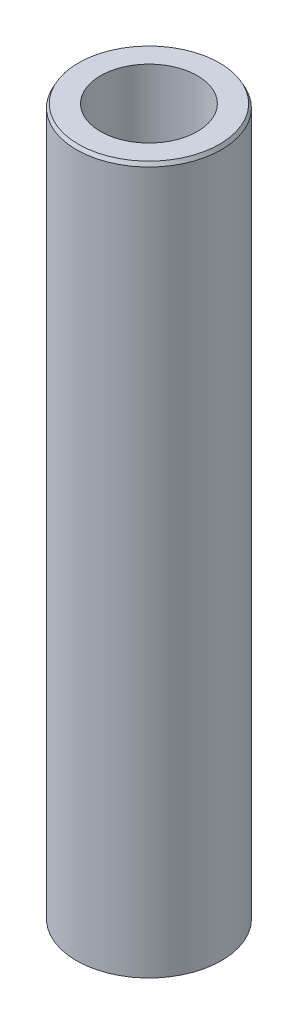
ISO-10303-21;
HEADER;
FILE_DESCRIPTION(('STEP AP214'),'2;1');
FILE_NAME('part.step','',(''),(''),'','','');
FILE_SCHEMA(('AUTOMOTIVE_DESIGN { 1 0 10303 214 1 1 1 1 }'));
ENDSEC;
DATA;
#1=APPLICATION_CONTEXT('core data for automotive mechanical design processes');
#2=APPLICATION_PROTOCOL_DEFINITION('international standard','automotive_design',2000,#1);
#3=PRODUCT_CONTEXT('',#1,'mechanical');
#4=PRODUCT('Part','Part','',(#3));
#5=PRODUCT_RELATED_PRODUCT_CATEGORY('part','',(#4));
#6=PRODUCT_DEFINITION_FORMATION('','',#4);
#7=PRODUCT_DEFINITION_CONTEXT('part definition',#1,'design');
#8=PRODUCT_DEFINITION('design','',#6,#7);
#9=PRODUCT_DEFINITION_SHAPE('','',#8);
#10=(LENGTH_UNIT() NAMED_UNIT(*) SI_UNIT(.MILLI.,.METRE.));
#11=(NAMED_UNIT(*) PLANE_ANGLE_UNIT() SI_UNIT($,.RADIAN.));
#12=(NAMED_UNIT(*) SI_UNIT($,.STERADIAN.) SOLID_ANGLE_UNIT());
#13=UNCERTAINTY_MEASURE_WITH_UNIT(LENGTH_MEASURE(1.E-05),#10,'distance_accuracy_value','');
#14=(GEOMETRIC_REPRESENTATION_CONTEXT(3) GLOBAL_UNCERTAINTY_ASSIGNED_CONTEXT((#13)) GLOBAL_UNIT_ASSIGNED_CONTEXT((#10,
#11,#12)) REPRESENTATION_CONTEXT('',''));
#15=CARTESIAN_POINT('',(0.,0.,0.));
#16=DIRECTION('',(0.,0.,1.));
#17=DIRECTION('',(1.,0.,0.));
#18=AXIS2_PLACEMENT_3D('',#15,#16,#17);
#19=CARTESIAN_POINT('',(0.,561.43512228351,0.));
#20=DIRECTION('',(0.,-1.,0.));
#21=DIRECTION('',(0.,0.,-1.));
#22=AXIS2_PLACEMENT_3D('',#19,#20,#21);
#23=CYLINDRICAL_SURFACE('',#22,57.5);
#24=CARTESIAN_POINT('',(0.,558.495638172747,0.));
#25=DIRECTION('',(0.,1.,0.));
#26=DIRECTION('',(0.,0.,1.));
#27=AXIS2_PLACEMENT_3D('',#24,#25,#26);
#28=CIRCLE('',#27,57.5);
#29=CARTESIAN_POINT('',(0.,558.495638172747,57.5));
#30=VERTEX_POINT('',#29);
#31=EDGE_CURVE('E50',#30,#30,#28,.F.);
#32=ORIENTED_EDGE('',*,*,#31,.T.);
#33=EDGE_LOOP('',(#32));
#34=FACE_BOUND('',#33,.T.);
#35=CARTESIAN_POINT('',(0.,1.56962324515264,0.));
#36=DIRECTION('',(0.,1.,0.));
#37=DIRECTION('',(0.,0.,1.));
#38=AXIS2_PLACEMENT_3D('',#35,#36,#37);
#39=CIRCLE('',#38,57.5);
#40=CARTESIAN_POINT('',(0.,1.56962324515264,57.5));
#41=VERTEX_POINT('',#40);
#42=EDGE_CURVE('E51',#41,#41,#39,.T.);
#43=ORIENTED_EDGE('',*,*,#42,.T.);
#44=EDGE_LOOP('',(#43));
#45=FACE_BOUND('',#44,.T.);
#46=ADVANCED_FACE('F39',(#34,#45),#23,.T.);
#47=CARTESIAN_POINT('',(0.,561.43512228351,0.));
#48=DIRECTION('',(0.,1.,0.));
#49=DIRECTION('',(0.,0.,1.));
#50=AXIS2_PLACEMENT_3D('',#47,#48,#49);
#51=PLANE('',#50);
#52=CARTESIAN_POINT('',(0.,561.43512228351,0.));
#53=DIRECTION('',(0.,1.,0.));
#54=DIRECTION('',(0.,0.,1.));
#55=AXIS2_PLACEMENT_3D('',#52,#53,#54);
#56=CIRCLE('',#55,55.9303767548472);
#57=CARTESIAN_POINT('',(0.,561.43512228351,55.9303767548472));
#58=VERTEX_POINT('',#57);
#59=EDGE_CURVE('E54',#58,#58,#56,.T.);
#60=ORIENTED_EDGE('',*,*,#59,.T.);
#61=EDGE_LOOP('',(#60));
#62=FACE_BOUND('',#61,.T.);
#63=CARTESIAN_POINT('',(0.,561.43512228351,0.));
#64=DIRECTION('',(0.,1.,0.));
#65=DIRECTION('',(0.,0.,1.));
#66=AXIS2_PLACEMENT_3D('',#63,#64,#65);
#67=CIRCLE('',#66,38.3782562558477);
#68=CARTESIAN_POINT('',(0.,561.43512228351,38.3782562558477));
#69=VERTEX_POINT('',#68);
#70=EDGE_CURVE('E58',#69,#69,#67,.T.);
#71=ORIENTED_EDGE('',*,*,#70,.F.);
#72=EDGE_LOOP('',(#71));
#73=FACE_BOUND('',#72,.T.);
#74=ADVANCED_FACE('F69',(#62,#73),#51,.T.);
#75=CARTESIAN_POINT('',(0.,0.,0.));
#76=DIRECTION('',(0.,1.,0.));
#77=DIRECTION('',(0.,0.,1.));
#78=AXIS2_PLACEMENT_3D('',#75,#76,#77);
#79=PLANE('',#78);
#80=CARTESIAN_POINT('',(0.,0.,0.));
#81=DIRECTION('',(0.,1.,0.));
#82=DIRECTION('',(0.,0.,1.));
#83=AXIS2_PLACEMENT_3D('',#80,#81,#82);
#84=CIRCLE('',#83,54.5605158892379);
#85=CARTESIAN_POINT('',(0.,0.,54.5605158892379));
#86=VERTEX_POINT('',#85);
#87=EDGE_CURVE('E10',#86,#86,#84,.F.);
#88=ORIENTED_EDGE('',*,*,#87,.T.);
#89=EDGE_LOOP('',(#88));
#90=FACE_BOUND('',#89,.T.);
#91=CARTESIAN_POINT('',(0.,0.,0.));
#92=DIRECTION('',(0.,1.,0.));
#93=DIRECTION('',(0.,0.,1.));
#94=AXIS2_PLACEMENT_3D('',#91,#92,#93);
#95=CIRCLE('',#94,38.3782562558477);
#96=CARTESIAN_POINT('',(0.,0.,38.3782562558477));
#97=VERTEX_POINT('',#96);
#98=EDGE_CURVE('E63',#97,#97,#95,.T.);
#99=ORIENTED_EDGE('',*,*,#98,.T.);
#100=EDGE_LOOP('',(#99));
#101=FACE_BOUND('',#100,.T.);
#102=ADVANCED_FACE('F75',(#90,#101),#79,.F.);
#103=CARTESIAN_POINT('',(0.,561.43512228351,0.));
#104=DIRECTION('',(0.,-1.,0.));
#105=DIRECTION('',(0.,0.,-1.));
#106=AXIS2_PLACEMENT_3D('',#103,#104,#105);
#107=CYLINDRICAL_SURFACE('',#106,38.3782562558477);
#108=ORIENTED_EDGE('',*,*,#70,.T.);
#109=EDGE_LOOP('',(#108));
#110=FACE_BOUND('',#109,.T.);
#111=ORIENTED_EDGE('',*,*,#98,.F.);
#112=EDGE_LOOP('',(#111));
#113=FACE_BOUND('',#112,.T.);
#114=ADVANCED_FACE('F70',(#110,#113),#107,.F.);
#115=CARTESIAN_POINT('',(0.,561.43512228351,0.));
#116=DIRECTION('',(0.,-1.,0.));
#117=DIRECTION('',(0.,0.,-1.));
#118=AXIS2_PLACEMENT_3D('',#115,#116,#117);
#119=CONICAL_SURFACE('',#118,55.9303767548472,0.490459994691347);
#120=ORIENTED_EDGE('',*,*,#31,.F.);
#121=EDGE_LOOP('',(#120));
#122=FACE_BOUND('',#121,.T.);
#123=ORIENTED_EDGE('',*,*,#59,.F.);
#124=EDGE_LOOP('',(#123));
#125=FACE_BOUND('',#124,.T.);
#126=ADVANCED_FACE('F81',(#122,#125),#119,.T.);
#127=CARTESIAN_POINT('',(0.,1.56962324515264,0.));
#128=DIRECTION('',(0.,1.,0.));
#129=DIRECTION('',(0.,0.,1.));
#130=AXIS2_PLACEMENT_3D('',#127,#128,#129);
#131=CONICAL_SURFACE('',#130,57.5,1.08033633210355);
#132=ORIENTED_EDGE('',*,*,#87,.F.);
#133=EDGE_LOOP('',(#132));
#134=FACE_BOUND('',#133,.T.);
#135=ORIENTED_EDGE('',*,*,#42,.F.);
#136=EDGE_LOOP('',(#135));
#137=FACE_BOUND('',#136,.T.);
#138=ADVANCED_FACE('F45',(#134,#137),#131,.T.);
#139=CLOSED_SHELL('',(#46,#74,#102,#114,#126,#138));
#140=MANIFOLD_SOLID_BREP('B2',#139);
#141=ADVANCED_BREP_SHAPE_REPRESENTATION('',(#18,#140),#14);
#142=SHAPE_DEFINITION_REPRESENTATION(#9,#141);
ENDSEC;
END-ISO-10303-21;
